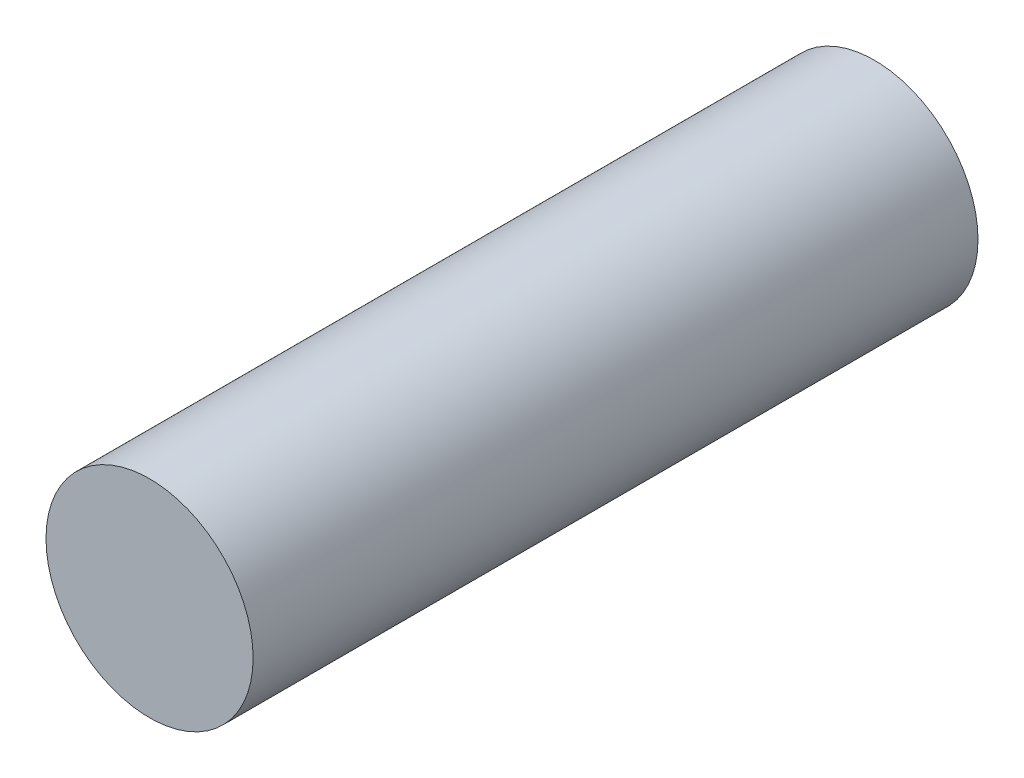
ISO-10303-21;
HEADER;
FILE_DESCRIPTION(('STEP AP214'),'2;1');
FILE_NAME('part.step','',(''),(''),'','','');
FILE_SCHEMA(('AUTOMOTIVE_DESIGN { 1 0 10303 214 1 1 1 1 }'));
ENDSEC;
DATA;
#1=APPLICATION_CONTEXT('core data for automotive mechanical design processes');
#2=APPLICATION_PROTOCOL_DEFINITION('international standard','automotive_design',2000,#1);
#3=PRODUCT_CONTEXT('',#1,'mechanical');
#4=PRODUCT('Part','Part','',(#3));
#5=PRODUCT_RELATED_PRODUCT_CATEGORY('part','',(#4));
#6=PRODUCT_DEFINITION_FORMATION('','',#4);
#7=PRODUCT_DEFINITION_CONTEXT('part definition',#1,'design');
#8=PRODUCT_DEFINITION('design','',#6,#7);
#9=PRODUCT_DEFINITION_SHAPE('','',#8);
#10=(LENGTH_UNIT() NAMED_UNIT(*) SI_UNIT(.MILLI.,.METRE.));
#11=(NAMED_UNIT(*) PLANE_ANGLE_UNIT() SI_UNIT($,.RADIAN.));
#12=(NAMED_UNIT(*) SI_UNIT($,.STERADIAN.) SOLID_ANGLE_UNIT());
#13=UNCERTAINTY_MEASURE_WITH_UNIT(LENGTH_MEASURE(1.E-05),#10,'distance_accuracy_value','');
#14=(GEOMETRIC_REPRESENTATION_CONTEXT(3) GLOBAL_UNCERTAINTY_ASSIGNED_CONTEXT((#13)) GLOBAL_UNIT_ASSIGNED_CONTEXT((#10,
#11,#12)) REPRESENTATION_CONTEXT('',''));
#15=CARTESIAN_POINT('',(0.,0.,0.));
#16=DIRECTION('',(0.,0.,1.));
#17=DIRECTION('',(1.,0.,0.));
#18=AXIS2_PLACEMENT_3D('',#15,#16,#17);
#19=CARTESIAN_POINT('',(0.,0.231823495963538,4.445));
#20=DIRECTION('',(0.,0.,-1.));
#21=DIRECTION('',(-1.,0.,0.));
#22=AXIS2_PLACEMENT_3D('',#19,#20,#21);
#23=CYLINDRICAL_SURFACE('',#22,0.635);
#24=CARTESIAN_POINT('',(0.,0.231823495963538,4.445));
#25=DIRECTION('',(0.,0.,1.));
#26=DIRECTION('',(1.,0.,0.));
#27=AXIS2_PLACEMENT_3D('',#24,#25,#26);
#28=CIRCLE('',#27,0.635);
#29=CARTESIAN_POINT('',(0.635,0.231823495963538,4.445));
#30=VERTEX_POINT('',#29);
#31=EDGE_CURVE('E10',#30,#30,#28,.T.);
#32=ORIENTED_EDGE('',*,*,#31,.F.);
#33=EDGE_LOOP('',(#32));
#34=FACE_BOUND('',#33,.T.);
#35=CARTESIAN_POINT('',(0.,0.231823495963538,0.));
#36=DIRECTION('',(0.,0.,1.));
#37=DIRECTION('',(1.,0.,0.));
#38=AXIS2_PLACEMENT_3D('',#35,#36,#37);
#39=CIRCLE('',#38,0.635);
#40=CARTESIAN_POINT('',(0.635,0.231823495963538,0.));
#41=VERTEX_POINT('',#40);
#42=EDGE_CURVE('E34',#41,#41,#39,.T.);
#43=ORIENTED_EDGE('',*,*,#42,.T.);
#44=EDGE_LOOP('',(#43));
#45=FACE_BOUND('',#44,.T.);
#46=ADVANCED_FACE('F31',(#34,#45),#23,.T.);
#47=CARTESIAN_POINT('',(0.,0.231823495963538,4.445));
#48=DIRECTION('',(0.,0.,1.));
#49=DIRECTION('',(1.,0.,0.));
#50=AXIS2_PLACEMENT_3D('',#47,#48,#49);
#51=PLANE('',#50);
#52=ORIENTED_EDGE('',*,*,#31,.T.);
#53=EDGE_LOOP('',(#52));
#54=FACE_BOUND('',#53,.T.);
#55=ADVANCED_FACE('F46',(#54),#51,.T.);
#56=CARTESIAN_POINT('',(0.,0.231823495963538,0.));
#57=DIRECTION('',(0.,0.,1.));
#58=DIRECTION('',(1.,0.,0.));
#59=AXIS2_PLACEMENT_3D('',#56,#57,#58);
#60=PLANE('',#59);
#61=ORIENTED_EDGE('',*,*,#42,.F.);
#62=EDGE_LOOP('',(#61));
#63=FACE_BOUND('',#62,.T.);
#64=ADVANCED_FACE('F44',(#63),#60,.F.);
#65=CLOSED_SHELL('',(#46,#55,#64));
#66=MANIFOLD_SOLID_BREP('B2',#65);
#67=ADVANCED_BREP_SHAPE_REPRESENTATION('',(#18,#66),#14);
#68=SHAPE_DEFINITION_REPRESENTATION(#9,#67);
ENDSEC;
END-ISO-10303-21;
